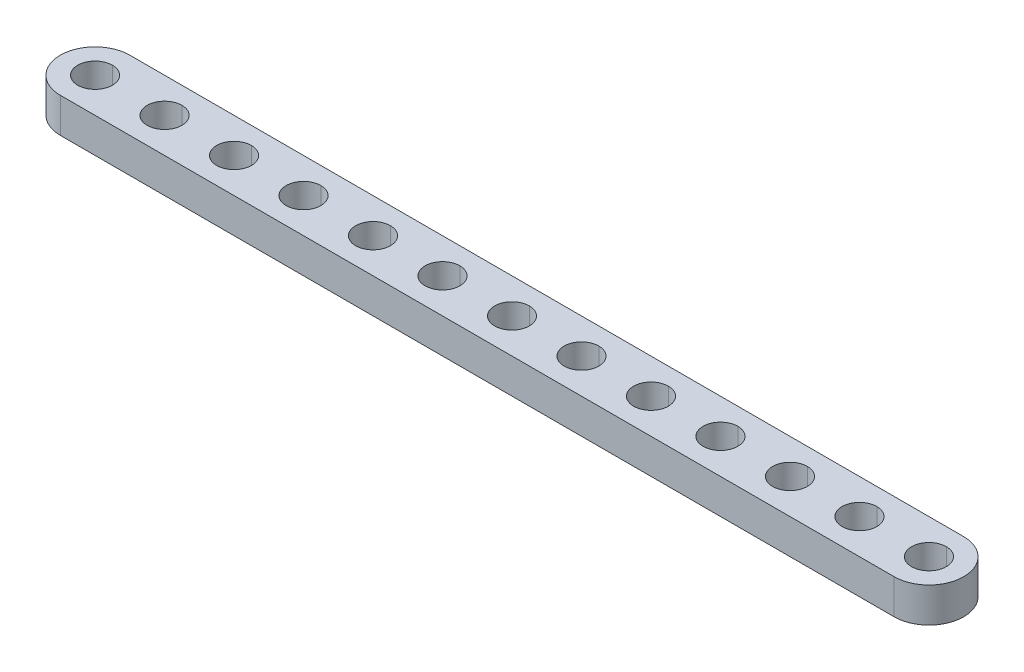
ISO-10303-21;
HEADER;
FILE_DESCRIPTION(('STEP AP214'),'2;1');
FILE_NAME('part.step','',(''),(''),'','','');
FILE_SCHEMA(('AUTOMOTIVE_DESIGN { 1 0 10303 214 1 1 1 1 }'));
ENDSEC;
DATA;
#1=APPLICATION_CONTEXT('core data for automotive mechanical design processes');
#2=APPLICATION_PROTOCOL_DEFINITION('international standard','automotive_design',2000,#1);
#3=PRODUCT_CONTEXT('',#1,'mechanical');
#4=PRODUCT('Part','Part','',(#3));
#5=PRODUCT_RELATED_PRODUCT_CATEGORY('part','',(#4));
#6=PRODUCT_DEFINITION_FORMATION('','',#4);
#7=PRODUCT_DEFINITION_CONTEXT('part definition',#1,'design');
#8=PRODUCT_DEFINITION('design','',#6,#7);
#9=PRODUCT_DEFINITION_SHAPE('','',#8);
#10=(LENGTH_UNIT() NAMED_UNIT(*) SI_UNIT(.MILLI.,.METRE.));
#11=(NAMED_UNIT(*) PLANE_ANGLE_UNIT() SI_UNIT($,.RADIAN.));
#12=(NAMED_UNIT(*) SI_UNIT($,.STERADIAN.) SOLID_ANGLE_UNIT());
#13=UNCERTAINTY_MEASURE_WITH_UNIT(LENGTH_MEASURE(1.E-05),#10,'distance_accuracy_value','');
#14=(GEOMETRIC_REPRESENTATION_CONTEXT(3) GLOBAL_UNCERTAINTY_ASSIGNED_CONTEXT((#13)) GLOBAL_UNIT_ASSIGNED_CONTEXT((#10,
#11,#12)) REPRESENTATION_CONTEXT('',''));
#15=CARTESIAN_POINT('',(0.,0.,0.));
#16=DIRECTION('',(0.,0.,1.));
#17=DIRECTION('',(1.,0.,0.));
#18=AXIS2_PLACEMENT_3D('',#15,#16,#17);
#19=CARTESIAN_POINT('',(48.,4.,0.));
#20=DIRECTION('',(0.,1.,0.));
#21=DIRECTION('',(0.,0.,1.));
#22=AXIS2_PLACEMENT_3D('',#19,#20,#21);
#23=CYLINDRICAL_SURFACE('',#22,2.);
#24=DIRECTION('',(0.,1.,0.));
#25=VECTOR('',#24,1.);
#26=CARTESIAN_POINT('',(48.,4.,-2.));
#27=LINE('',#26,#25);
#28=CARTESIAN_POINT('',(48.,0.,-2.));
#29=VERTEX_POINT('',#28);
#30=CARTESIAN_POINT('',(48.,4.,-2.));
#31=VERTEX_POINT('',#30);
#32=EDGE_CURVE('E298',#29,#31,#27,.T.);
#33=ORIENTED_EDGE('',*,*,#32,.F.);
#34=CARTESIAN_POINT('',(48.,0.,0.));
#35=DIRECTION('',(0.,1.,0.));
#36=DIRECTION('',(0.,0.,1.));
#37=AXIS2_PLACEMENT_3D('',#34,#35,#36);
#38=CIRCLE('',#37,2.);
#39=CARTESIAN_POINT('',(48.,0.,2.));
#40=VERTEX_POINT('',#39);
#41=EDGE_CURVE('E283',#40,#29,#38,.T.);
#42=ORIENTED_EDGE('',*,*,#41,.F.);
#43=DIRECTION('',(0.,1.,0.));
#44=VECTOR('',#43,1.);
#45=CARTESIAN_POINT('',(48.,4.,2.));
#46=LINE('',#45,#44);
#47=CARTESIAN_POINT('',(48.,4.,2.));
#48=VERTEX_POINT('',#47);
#49=EDGE_CURVE('E331',#40,#48,#46,.T.);
#50=ORIENTED_EDGE('',*,*,#49,.T.);
#51=CARTESIAN_POINT('',(48.,4.,0.));
#52=DIRECTION('',(0.,1.,0.));
#53=DIRECTION('',(0.,0.,1.));
#54=AXIS2_PLACEMENT_3D('',#51,#52,#53);
#55=CIRCLE('',#54,2.);
#56=EDGE_CURVE('E362',#48,#31,#55,.T.);
#57=ORIENTED_EDGE('',*,*,#56,.T.);
#58=EDGE_LOOP('',(#33,#42,#50,#57));
#59=FACE_BOUND('',#58,.T.);
#60=ADVANCED_FACE('F14',(#59),#23,.F.);
#61=CARTESIAN_POINT('',(40.,4.,0.));
#62=DIRECTION('',(0.,1.,0.));
#63=DIRECTION('',(0.,0.,1.));
#64=AXIS2_PLACEMENT_3D('',#61,#62,#63);
#65=CYLINDRICAL_SURFACE('',#64,2.);
#66=DIRECTION('',(0.,1.,0.));
#67=VECTOR('',#66,1.);
#68=CARTESIAN_POINT('',(40.,4.,-2.));
#69=LINE('',#68,#67);
#70=CARTESIAN_POINT('',(40.,0.,-2.));
#71=VERTEX_POINT('',#70);
#72=CARTESIAN_POINT('',(40.,4.,-2.));
#73=VERTEX_POINT('',#72);
#74=EDGE_CURVE('E348',#71,#73,#69,.T.);
#75=ORIENTED_EDGE('',*,*,#74,.F.);
#76=CARTESIAN_POINT('',(40.,0.,0.));
#77=DIRECTION('',(0.,1.,0.));
#78=DIRECTION('',(0.,0.,1.));
#79=AXIS2_PLACEMENT_3D('',#76,#77,#78);
#80=CIRCLE('',#79,2.);
#81=CARTESIAN_POINT('',(40.,0.,2.));
#82=VERTEX_POINT('',#81);
#83=EDGE_CURVE('E279',#82,#71,#80,.T.);
#84=ORIENTED_EDGE('',*,*,#83,.F.);
#85=DIRECTION('',(0.,1.,0.));
#86=VECTOR('',#85,1.);
#87=CARTESIAN_POINT('',(40.,4.,2.));
#88=LINE('',#87,#86);
#89=CARTESIAN_POINT('',(40.,4.,2.));
#90=VERTEX_POINT('',#89);
#91=EDGE_CURVE('E347',#82,#90,#88,.T.);
#92=ORIENTED_EDGE('',*,*,#91,.T.);
#93=CARTESIAN_POINT('',(40.,4.,0.));
#94=DIRECTION('',(0.,1.,0.));
#95=DIRECTION('',(0.,0.,1.));
#96=AXIS2_PLACEMENT_3D('',#93,#94,#95);
#97=CIRCLE('',#96,2.);
#98=EDGE_CURVE('E358',#90,#73,#97,.T.);
#99=ORIENTED_EDGE('',*,*,#98,.T.);
#100=EDGE_LOOP('',(#75,#84,#92,#99));
#101=FACE_BOUND('',#100,.T.);
#102=ADVANCED_FACE('F818',(#101),#65,.F.);
#103=CARTESIAN_POINT('',(32.,4.,0.));
#104=DIRECTION('',(0.,1.,0.));
#105=DIRECTION('',(0.,0.,1.));
#106=AXIS2_PLACEMENT_3D('',#103,#104,#105);
#107=CYLINDRICAL_SURFACE('',#106,2.);
#108=DIRECTION('',(0.,1.,0.));
#109=VECTOR('',#108,1.);
#110=CARTESIAN_POINT('',(32.,4.,-2.));
#111=LINE('',#110,#109);
#112=CARTESIAN_POINT('',(32.,0.,-2.));
#113=VERTEX_POINT('',#112);
#114=CARTESIAN_POINT('',(32.,4.,-2.));
#115=VERTEX_POINT('',#114);
#116=EDGE_CURVE('E316',#113,#115,#111,.T.);
#117=ORIENTED_EDGE('',*,*,#116,.F.);
#118=CARTESIAN_POINT('',(32.,0.,0.));
#119=DIRECTION('',(0.,1.,0.));
#120=DIRECTION('',(0.,0.,1.));
#121=AXIS2_PLACEMENT_3D('',#118,#119,#120);
#122=CIRCLE('',#121,2.);
#123=CARTESIAN_POINT('',(32.,0.,2.));
#124=VERTEX_POINT('',#123);
#125=EDGE_CURVE('E282',#124,#113,#122,.T.);
#126=ORIENTED_EDGE('',*,*,#125,.F.);
#127=DIRECTION('',(0.,1.,0.));
#128=VECTOR('',#127,1.);
#129=CARTESIAN_POINT('',(32.,4.,2.));
#130=LINE('',#129,#128);
#131=CARTESIAN_POINT('',(32.,4.,2.));
#132=VERTEX_POINT('',#131);
#133=EDGE_CURVE('E370',#124,#132,#130,.T.);
#134=ORIENTED_EDGE('',*,*,#133,.T.);
#135=CARTESIAN_POINT('',(32.,4.,0.));
#136=DIRECTION('',(0.,1.,0.));
#137=DIRECTION('',(0.,0.,1.));
#138=AXIS2_PLACEMENT_3D('',#135,#136,#137);
#139=CIRCLE('',#138,2.);
#140=EDGE_CURVE('E315',#132,#115,#139,.T.);
#141=ORIENTED_EDGE('',*,*,#140,.T.);
#142=EDGE_LOOP('',(#117,#126,#134,#141));
#143=FACE_BOUND('',#142,.T.);
#144=ADVANCED_FACE('F441',(#143),#107,.F.);
#145=CARTESIAN_POINT('',(24.,4.,0.));
#146=DIRECTION('',(0.,1.,0.));
#147=DIRECTION('',(0.,0.,1.));
#148=AXIS2_PLACEMENT_3D('',#145,#146,#147);
#149=CYLINDRICAL_SURFACE('',#148,2.);
#150=DIRECTION('',(0.,1.,0.));
#151=VECTOR('',#150,1.);
#152=CARTESIAN_POINT('',(24.,4.,-2.));
#153=LINE('',#152,#151);
#154=CARTESIAN_POINT('',(24.,0.,-2.));
#155=VERTEX_POINT('',#154);
#156=CARTESIAN_POINT('',(24.,4.,-2.));
#157=VERTEX_POINT('',#156);
#158=EDGE_CURVE('E476',#155,#157,#153,.T.);
#159=ORIENTED_EDGE('',*,*,#158,.F.);
#160=CARTESIAN_POINT('',(24.,0.,0.));
#161=DIRECTION('',(0.,1.,0.));
#162=DIRECTION('',(0.,0.,1.));
#163=AXIS2_PLACEMENT_3D('',#160,#161,#162);
#164=CIRCLE('',#163,2.);
#165=CARTESIAN_POINT('',(24.,0.,2.));
#166=VERTEX_POINT('',#165);
#167=EDGE_CURVE('E306',#166,#155,#164,.T.);
#168=ORIENTED_EDGE('',*,*,#167,.F.);
#169=DIRECTION('',(0.,1.,0.));
#170=VECTOR('',#169,1.);
#171=CARTESIAN_POINT('',(24.,4.,2.));
#172=LINE('',#171,#170);
#173=CARTESIAN_POINT('',(24.,4.,2.));
#174=VERTEX_POINT('',#173);
#175=EDGE_CURVE('E239',#166,#174,#172,.T.);
#176=ORIENTED_EDGE('',*,*,#175,.T.);
#177=CARTESIAN_POINT('',(24.,4.,0.));
#178=DIRECTION('',(0.,1.,0.));
#179=DIRECTION('',(0.,0.,1.));
#180=AXIS2_PLACEMENT_3D('',#177,#178,#179);
#181=CIRCLE('',#180,2.);
#182=EDGE_CURVE('E310',#174,#157,#181,.T.);
#183=ORIENTED_EDGE('',*,*,#182,.T.);
#184=EDGE_LOOP('',(#159,#168,#176,#183));
#185=FACE_BOUND('',#184,.T.);
#186=ADVANCED_FACE('F817',(#185),#149,.F.);
#187=CARTESIAN_POINT('',(16.,4.,0.));
#188=DIRECTION('',(0.,1.,0.));
#189=DIRECTION('',(0.,0.,1.));
#190=AXIS2_PLACEMENT_3D('',#187,#188,#189);
#191=CYLINDRICAL_SURFACE('',#190,2.);
#192=DIRECTION('',(0.,1.,0.));
#193=VECTOR('',#192,1.);
#194=CARTESIAN_POINT('',(16.,4.,-2.));
#195=LINE('',#194,#193);
#196=CARTESIAN_POINT('',(16.,0.,-2.));
#197=VERTEX_POINT('',#196);
#198=CARTESIAN_POINT('',(16.,4.,-2.));
#199=VERTEX_POINT('',#198);
#200=EDGE_CURVE('E238',#197,#199,#195,.T.);
#201=ORIENTED_EDGE('',*,*,#200,.F.);
#202=CARTESIAN_POINT('',(16.,0.,0.));
#203=DIRECTION('',(0.,1.,0.));
#204=DIRECTION('',(0.,0.,1.));
#205=AXIS2_PLACEMENT_3D('',#202,#203,#204);
#206=CIRCLE('',#205,2.);
#207=CARTESIAN_POINT('',(16.,0.,2.));
#208=VERTEX_POINT('',#207);
#209=EDGE_CURVE('E330',#208,#197,#206,.T.);
#210=ORIENTED_EDGE('',*,*,#209,.F.);
#211=DIRECTION('',(0.,1.,0.));
#212=VECTOR('',#211,1.);
#213=CARTESIAN_POINT('',(16.,4.,2.));
#214=LINE('',#213,#212);
#215=CARTESIAN_POINT('',(16.,4.,2.));
#216=VERTEX_POINT('',#215);
#217=EDGE_CURVE('E352',#208,#216,#214,.T.);
#218=ORIENTED_EDGE('',*,*,#217,.T.);
#219=CARTESIAN_POINT('',(16.,4.,0.));
#220=DIRECTION('',(0.,1.,0.));
#221=DIRECTION('',(0.,0.,1.));
#222=AXIS2_PLACEMENT_3D('',#219,#220,#221);
#223=CIRCLE('',#222,2.);
#224=EDGE_CURVE('E314',#216,#199,#223,.T.);
#225=ORIENTED_EDGE('',*,*,#224,.T.);
#226=EDGE_LOOP('',(#201,#210,#218,#225));
#227=FACE_BOUND('',#226,.T.);
#228=ADVANCED_FACE('F809',(#227),#191,.F.);
#229=CARTESIAN_POINT('',(8.,4.,0.));
#230=DIRECTION('',(0.,1.,0.));
#231=DIRECTION('',(0.,0.,1.));
#232=AXIS2_PLACEMENT_3D('',#229,#230,#231);
#233=CYLINDRICAL_SURFACE('',#232,2.);
#234=DIRECTION('',(0.,1.,0.));
#235=VECTOR('',#234,1.);
#236=CARTESIAN_POINT('',(8.,4.,-2.));
#237=LINE('',#236,#235);
#238=CARTESIAN_POINT('',(8.,0.,-2.));
#239=VERTEX_POINT('',#238);
#240=CARTESIAN_POINT('',(8.,4.,-2.));
#241=VERTEX_POINT('',#240);
#242=EDGE_CURVE('E297',#239,#241,#237,.T.);
#243=ORIENTED_EDGE('',*,*,#242,.F.);
#244=CARTESIAN_POINT('',(8.,0.,0.));
#245=DIRECTION('',(0.,1.,0.));
#246=DIRECTION('',(0.,0.,1.));
#247=AXIS2_PLACEMENT_3D('',#244,#245,#246);
#248=CIRCLE('',#247,2.);
#249=CARTESIAN_POINT('',(8.,0.,2.));
#250=VERTEX_POINT('',#249);
#251=EDGE_CURVE('E18',#250,#239,#248,.T.);
#252=ORIENTED_EDGE('',*,*,#251,.F.);
#253=DIRECTION('',(0.,1.,0.));
#254=VECTOR('',#253,1.);
#255=CARTESIAN_POINT('',(8.,4.,2.));
#256=LINE('',#255,#254);
#257=CARTESIAN_POINT('',(8.,4.,2.));
#258=VERTEX_POINT('',#257);
#259=EDGE_CURVE('E233',#250,#258,#256,.T.);
#260=ORIENTED_EDGE('',*,*,#259,.T.);
#261=CARTESIAN_POINT('',(8.,4.,0.));
#262=DIRECTION('',(0.,1.,0.));
#263=DIRECTION('',(0.,0.,1.));
#264=AXIS2_PLACEMENT_3D('',#261,#262,#263);
#265=CIRCLE('',#264,2.);
#266=EDGE_CURVE('E392',#258,#241,#265,.T.);
#267=ORIENTED_EDGE('',*,*,#266,.T.);
#268=EDGE_LOOP('',(#243,#252,#260,#267));
#269=FACE_BOUND('',#268,.T.);
#270=ADVANCED_FACE('F576',(#269),#233,.F.);
#271=CARTESIAN_POINT('',(0.,4.,0.));
#272=DIRECTION('',(0.,1.,0.));
#273=DIRECTION('',(0.,0.,1.));
#274=AXIS2_PLACEMENT_3D('',#271,#272,#273);
#275=CYLINDRICAL_SURFACE('',#274,2.);
#276=DIRECTION('',(0.,1.,0.));
#277=VECTOR('',#276,1.);
#278=CARTESIAN_POINT('',(0.,4.,-2.));
#279=LINE('',#278,#277);
#280=CARTESIAN_POINT('',(0.,0.,-2.));
#281=VERTEX_POINT('',#280);
#282=CARTESIAN_POINT('',(0.,4.,-2.));
#283=VERTEX_POINT('',#282);
#284=EDGE_CURVE('E287',#281,#283,#279,.T.);
#285=ORIENTED_EDGE('',*,*,#284,.F.);
#286=CARTESIAN_POINT('',(0.,0.,0.));
#287=DIRECTION('',(0.,1.,0.));
#288=DIRECTION('',(0.,0.,1.));
#289=AXIS2_PLACEMENT_3D('',#286,#287,#288);
#290=CIRCLE('',#289,2.);
#291=CARTESIAN_POINT('',(0.,0.,2.));
#292=VERTEX_POINT('',#291);
#293=EDGE_CURVE('E432',#292,#281,#290,.T.);
#294=ORIENTED_EDGE('',*,*,#293,.F.);
#295=DIRECTION('',(0.,1.,0.));
#296=VECTOR('',#295,1.);
#297=CARTESIAN_POINT('',(0.,4.,2.));
#298=LINE('',#297,#296);
#299=CARTESIAN_POINT('',(0.,4.,2.));
#300=VERTEX_POINT('',#299);
#301=EDGE_CURVE('E268',#292,#300,#298,.T.);
#302=ORIENTED_EDGE('',*,*,#301,.T.);
#303=CARTESIAN_POINT('',(0.,4.,0.));
#304=DIRECTION('',(0.,1.,0.));
#305=DIRECTION('',(0.,0.,1.));
#306=AXIS2_PLACEMENT_3D('',#303,#304,#305);
#307=CIRCLE('',#306,2.);
#308=EDGE_CURVE('E518',#300,#283,#307,.T.);
#309=ORIENTED_EDGE('',*,*,#308,.T.);
#310=EDGE_LOOP('',(#285,#294,#302,#309));
#311=FACE_BOUND('',#310,.T.);
#312=ADVANCED_FACE('F808',(#311),#275,.F.);
#313=CARTESIAN_POINT('',(-8.,4.,0.));
#314=DIRECTION('',(0.,1.,0.));
#315=DIRECTION('',(0.,0.,1.));
#316=AXIS2_PLACEMENT_3D('',#313,#314,#315);
#317=CYLINDRICAL_SURFACE('',#316,2.);
#318=DIRECTION('',(0.,1.,0.));
#319=VECTOR('',#318,1.);
#320=CARTESIAN_POINT('',(-8.,4.,-2.));
#321=LINE('',#320,#319);
#322=CARTESIAN_POINT('',(-8.,0.,-2.));
#323=VERTEX_POINT('',#322);
#324=CARTESIAN_POINT('',(-8.,4.,-2.));
#325=VERTEX_POINT('',#324);
#326=EDGE_CURVE('E486',#323,#325,#321,.T.);
#327=ORIENTED_EDGE('',*,*,#326,.F.);
#328=CARTESIAN_POINT('',(-8.,0.,0.));
#329=DIRECTION('',(0.,1.,0.));
#330=DIRECTION('',(0.,0.,1.));
#331=AXIS2_PLACEMENT_3D('',#328,#329,#330);
#332=CIRCLE('',#331,2.);
#333=CARTESIAN_POINT('',(-8.,0.,2.));
#334=VERTEX_POINT('',#333);
#335=EDGE_CURVE('E402',#334,#323,#332,.T.);
#336=ORIENTED_EDGE('',*,*,#335,.F.);
#337=DIRECTION('',(0.,1.,0.));
#338=VECTOR('',#337,1.);
#339=CARTESIAN_POINT('',(-8.,4.,2.));
#340=LINE('',#339,#338);
#341=CARTESIAN_POINT('',(-8.,4.,2.));
#342=VERTEX_POINT('',#341);
#343=EDGE_CURVE('E388',#334,#342,#340,.T.);
#344=ORIENTED_EDGE('',*,*,#343,.T.);
#345=CARTESIAN_POINT('',(-8.,4.,0.));
#346=DIRECTION('',(0.,1.,0.));
#347=DIRECTION('',(0.,0.,1.));
#348=AXIS2_PLACEMENT_3D('',#345,#346,#347);
#349=CIRCLE('',#348,2.);
#350=EDGE_CURVE('E292',#342,#325,#349,.T.);
#351=ORIENTED_EDGE('',*,*,#350,.T.);
#352=EDGE_LOOP('',(#327,#336,#344,#351));
#353=FACE_BOUND('',#352,.T.);
#354=ADVANCED_FACE('F859',(#353),#317,.F.);
#355=CARTESIAN_POINT('',(-16.,4.,0.));
#356=DIRECTION('',(0.,1.,0.));
#357=DIRECTION('',(0.,0.,1.));
#358=AXIS2_PLACEMENT_3D('',#355,#356,#357);
#359=CYLINDRICAL_SURFACE('',#358,2.);
#360=DIRECTION('',(0.,1.,0.));
#361=VECTOR('',#360,1.);
#362=CARTESIAN_POINT('',(-16.,4.,-2.));
#363=LINE('',#362,#361);
#364=CARTESIAN_POINT('',(-16.,0.,-2.));
#365=VERTEX_POINT('',#364);
#366=CARTESIAN_POINT('',(-16.,4.,-2.));
#367=VERTEX_POINT('',#366);
#368=EDGE_CURVE('E357',#365,#367,#363,.T.);
#369=ORIENTED_EDGE('',*,*,#368,.F.);
#370=CARTESIAN_POINT('',(-16.,0.,0.));
#371=DIRECTION('',(0.,1.,0.));
#372=DIRECTION('',(0.,0.,1.));
#373=AXIS2_PLACEMENT_3D('',#370,#371,#372);
#374=CIRCLE('',#373,2.);
#375=CARTESIAN_POINT('',(-16.,0.,2.));
#376=VERTEX_POINT('',#375);
#377=EDGE_CURVE('E398',#376,#365,#374,.T.);
#378=ORIENTED_EDGE('',*,*,#377,.F.);
#379=DIRECTION('',(0.,1.,0.));
#380=VECTOR('',#379,1.);
#381=CARTESIAN_POINT('',(-16.,4.,2.));
#382=LINE('',#381,#380);
#383=CARTESIAN_POINT('',(-16.,4.,2.));
#384=VERTEX_POINT('',#383);
#385=EDGE_CURVE('E326',#376,#384,#382,.T.);
#386=ORIENTED_EDGE('',*,*,#385,.T.);
#387=CARTESIAN_POINT('',(-16.,4.,0.));
#388=DIRECTION('',(0.,1.,0.));
#389=DIRECTION('',(0.,0.,1.));
#390=AXIS2_PLACEMENT_3D('',#387,#388,#389);
#391=CIRCLE('',#390,2.);
#392=EDGE_CURVE('E288',#384,#367,#391,.T.);
#393=ORIENTED_EDGE('',*,*,#392,.T.);
#394=EDGE_LOOP('',(#369,#378,#386,#393));
#395=FACE_BOUND('',#394,.T.);
#396=ADVANCED_FACE('F901',(#395),#359,.F.);
#397=CARTESIAN_POINT('',(-24.,4.,0.));
#398=DIRECTION('',(0.,1.,0.));
#399=DIRECTION('',(0.,0.,1.));
#400=AXIS2_PLACEMENT_3D('',#397,#398,#399);
#401=CYLINDRICAL_SURFACE('',#400,2.);
#402=DIRECTION('',(0.,1.,0.));
#403=VECTOR('',#402,1.);
#404=CARTESIAN_POINT('',(-24.,4.,-2.));
#405=LINE('',#404,#403);
#406=CARTESIAN_POINT('',(-24.,0.,-2.));
#407=VERTEX_POINT('',#406);
#408=CARTESIAN_POINT('',(-24.,4.,-2.));
#409=VERTEX_POINT('',#408);
#410=EDGE_CURVE('E325',#407,#409,#405,.T.);
#411=ORIENTED_EDGE('',*,*,#410,.F.);
#412=CARTESIAN_POINT('',(-24.,0.,0.));
#413=DIRECTION('',(0.,1.,0.));
#414=DIRECTION('',(0.,0.,1.));
#415=AXIS2_PLACEMENT_3D('',#412,#413,#414);
#416=CIRCLE('',#415,2.);
#417=CARTESIAN_POINT('',(-24.,0.,2.));
#418=VERTEX_POINT('',#417);
#419=EDGE_CURVE('E401',#418,#407,#416,.T.);
#420=ORIENTED_EDGE('',*,*,#419,.F.);
#421=DIRECTION('',(0.,1.,0.));
#422=VECTOR('',#421,1.);
#423=CARTESIAN_POINT('',(-24.,4.,2.));
#424=LINE('',#423,#422);
#425=CARTESIAN_POINT('',(-24.,4.,2.));
#426=VERTEX_POINT('',#425);
#427=EDGE_CURVE('E229',#418,#426,#424,.T.);
#428=ORIENTED_EDGE('',*,*,#427,.T.);
#429=CARTESIAN_POINT('',(-24.,4.,0.));
#430=DIRECTION('',(0.,1.,0.));
#431=DIRECTION('',(0.,0.,1.));
#432=AXIS2_PLACEMENT_3D('',#429,#430,#431);
#433=CIRCLE('',#432,2.);
#434=EDGE_CURVE('E211',#426,#409,#433,.T.);
#435=ORIENTED_EDGE('',*,*,#434,.T.);
#436=EDGE_LOOP('',(#411,#420,#428,#435));
#437=FACE_BOUND('',#436,.T.);
#438=ADVANCED_FACE('F947',(#437),#401,.F.);
#439=CARTESIAN_POINT('',(-32.,4.,0.));
#440=DIRECTION('',(0.,1.,0.));
#441=DIRECTION('',(0.,0.,1.));
#442=AXIS2_PLACEMENT_3D('',#439,#440,#441);
#443=CYLINDRICAL_SURFACE('',#442,2.);
#444=DIRECTION('',(0.,1.,0.));
#445=VECTOR('',#444,1.);
#446=CARTESIAN_POINT('',(-32.,4.,-2.));
#447=LINE('',#446,#445);
#448=CARTESIAN_POINT('',(-32.,0.,-2.));
#449=VERTEX_POINT('',#448);
#450=CARTESIAN_POINT('',(-32.,4.,-2.));
#451=VERTEX_POINT('',#450);
#452=EDGE_CURVE('E203',#449,#451,#447,.T.);
#453=ORIENTED_EDGE('',*,*,#452,.F.);
#454=CARTESIAN_POINT('',(-32.,0.,0.));
#455=DIRECTION('',(0.,1.,0.));
#456=DIRECTION('',(0.,0.,1.));
#457=AXIS2_PLACEMENT_3D('',#454,#455,#456);
#458=CIRCLE('',#457,2.);
#459=CARTESIAN_POINT('',(-32.,0.,2.));
#460=VERTEX_POINT('',#459);
#461=EDGE_CURVE('E421',#460,#449,#458,.T.);
#462=ORIENTED_EDGE('',*,*,#461,.F.);
#463=DIRECTION('',(0.,1.,0.));
#464=VECTOR('',#463,1.);
#465=CARTESIAN_POINT('',(-32.,4.,2.));
#466=LINE('',#465,#464);
#467=CARTESIAN_POINT('',(-32.,4.,2.));
#468=VERTEX_POINT('',#467);
#469=EDGE_CURVE('E206',#460,#468,#466,.T.);
#470=ORIENTED_EDGE('',*,*,#469,.T.);
#471=CARTESIAN_POINT('',(-32.,4.,0.));
#472=DIRECTION('',(0.,1.,0.));
#473=DIRECTION('',(0.,0.,1.));
#474=AXIS2_PLACEMENT_3D('',#471,#472,#473);
#475=CIRCLE('',#474,2.);
#476=EDGE_CURVE('E199',#468,#451,#475,.T.);
#477=ORIENTED_EDGE('',*,*,#476,.T.);
#478=EDGE_LOOP('',(#453,#462,#470,#477));
#479=FACE_BOUND('',#478,.T.);
#480=ADVANCED_FACE('F201',(#479),#443,.F.);
#481=CARTESIAN_POINT('',(-40.,4.,0.));
#482=DIRECTION('',(0.,1.,0.));
#483=DIRECTION('',(0.,0.,1.));
#484=AXIS2_PLACEMENT_3D('',#481,#482,#483);
#485=CYLINDRICAL_SURFACE('',#484,2.);
#486=DIRECTION('',(0.,1.,0.));
#487=VECTOR('',#486,1.);
#488=CARTESIAN_POINT('',(-40.,4.,-2.));
#489=LINE('',#488,#487);
#490=CARTESIAN_POINT('',(-40.,0.,-2.));
#491=VERTEX_POINT('',#490);
#492=CARTESIAN_POINT('',(-40.,4.,-2.));
#493=VERTEX_POINT('',#492);
#494=EDGE_CURVE('E262',#491,#493,#489,.T.);
#495=ORIENTED_EDGE('',*,*,#494,.F.);
#496=CARTESIAN_POINT('',(-40.,0.,0.));
#497=DIRECTION('',(0.,1.,0.));
#498=DIRECTION('',(0.,0.,1.));
#499=AXIS2_PLACEMENT_3D('',#496,#497,#498);
#500=CIRCLE('',#499,2.);
#501=CARTESIAN_POINT('',(-40.,0.,2.));
#502=VERTEX_POINT('',#501);
#503=EDGE_CURVE('E25',#502,#491,#500,.T.);
#504=ORIENTED_EDGE('',*,*,#503,.F.);
#505=DIRECTION('',(0.,1.,0.));
#506=VECTOR('',#505,1.);
#507=CARTESIAN_POINT('',(-40.,4.,2.));
#508=LINE('',#507,#506);
#509=CARTESIAN_POINT('',(-40.,4.,2.));
#510=VERTEX_POINT('',#509);
#511=EDGE_CURVE('E267',#502,#510,#508,.T.);
#512=ORIENTED_EDGE('',*,*,#511,.T.);
#513=CARTESIAN_POINT('',(-40.,4.,0.));
#514=DIRECTION('',(0.,1.,0.));
#515=DIRECTION('',(0.,0.,1.));
#516=AXIS2_PLACEMENT_3D('',#513,#514,#515);
#517=CIRCLE('',#516,2.);
#518=EDGE_CURVE('E210',#510,#493,#517,.T.);
#519=ORIENTED_EDGE('',*,*,#518,.T.);
#520=EDGE_LOOP('',(#495,#504,#512,#519));
#521=FACE_BOUND('',#520,.T.);
#522=ADVANCED_FACE('F749',(#521),#485,.F.);
#523=CARTESIAN_POINT('',(-48.,4.,0.));
#524=DIRECTION('',(0.,1.,0.));
#525=DIRECTION('',(0.,0.,1.));
#526=AXIS2_PLACEMENT_3D('',#523,#524,#525);
#527=CYLINDRICAL_SURFACE('',#526,2.);
#528=DIRECTION('',(0.,1.,0.));
#529=VECTOR('',#528,1.);
#530=CARTESIAN_POINT('',(-48.,4.,-2.));
#531=LINE('',#530,#529);
#532=CARTESIAN_POINT('',(-48.,0.,-2.));
#533=VERTEX_POINT('',#532);
#534=CARTESIAN_POINT('',(-48.,4.,-2.));
#535=VERTEX_POINT('',#534);
#536=EDGE_CURVE('E416',#533,#535,#531,.T.);
#537=ORIENTED_EDGE('',*,*,#536,.F.);
#538=CARTESIAN_POINT('',(-48.,0.,0.));
#539=DIRECTION('',(0.,1.,0.));
#540=DIRECTION('',(0.,0.,1.));
#541=AXIS2_PLACEMENT_3D('',#538,#539,#540);
#542=CIRCLE('',#541,2.);
#543=CARTESIAN_POINT('',(-48.,0.,2.));
#544=VERTEX_POINT('',#543);
#545=EDGE_CURVE('E9',#544,#533,#542,.T.);
#546=ORIENTED_EDGE('',*,*,#545,.F.);
#547=DIRECTION('',(0.,1.,0.));
#548=VECTOR('',#547,1.);
#549=CARTESIAN_POINT('',(-48.,4.,2.));
#550=LINE('',#549,#548);
#551=CARTESIAN_POINT('',(-48.,4.,2.));
#552=VERTEX_POINT('',#551);
#553=EDGE_CURVE('E274',#544,#552,#550,.T.);
#554=ORIENTED_EDGE('',*,*,#553,.T.);
#555=CARTESIAN_POINT('',(-48.,4.,0.));
#556=DIRECTION('',(0.,1.,0.));
#557=DIRECTION('',(0.,0.,1.));
#558=AXIS2_PLACEMENT_3D('',#555,#556,#557);
#559=CIRCLE('',#558,2.);
#560=EDGE_CURVE('E363',#552,#535,#559,.T.);
#561=ORIENTED_EDGE('',*,*,#560,.T.);
#562=EDGE_LOOP('',(#537,#546,#554,#561));
#563=FACE_BOUND('',#562,.T.);
#564=ADVANCED_FACE('F753',(#563),#527,.F.);
#565=CARTESIAN_POINT('',(-48.,0.,0.));
#566=DIRECTION('',(0.,1.,0.));
#567=DIRECTION('',(1.,0.,0.));
#568=AXIS2_PLACEMENT_3D('',#565,#566,#567);
#569=PLANE('',#568);
#570=ORIENTED_EDGE('',*,*,#545,.T.);
#571=CARTESIAN_POINT('',(-48.,0.,0.));
#572=DIRECTION('',(0.,1.,0.));
#573=DIRECTION('',(0.,0.,1.));
#574=AXIS2_PLACEMENT_3D('',#571,#572,#573);
#575=CIRCLE('',#574,2.);
#576=EDGE_CURVE('E420',#533,#544,#575,.T.);
#577=ORIENTED_EDGE('',*,*,#576,.T.);
#578=EDGE_LOOP('',(#570,#577));
#579=FACE_BOUND('',#578,.T.);
#580=ORIENTED_EDGE('',*,*,#503,.T.);
#581=CARTESIAN_POINT('',(-40.,0.,0.));
#582=DIRECTION('',(0.,1.,0.));
#583=DIRECTION('',(0.,0.,1.));
#584=AXIS2_PLACEMENT_3D('',#581,#582,#583);
#585=CIRCLE('',#584,2.);
#586=EDGE_CURVE('E258',#491,#502,#585,.T.);
#587=ORIENTED_EDGE('',*,*,#586,.T.);
#588=EDGE_LOOP('',(#580,#587));
#589=FACE_BOUND('',#588,.T.);
#590=ORIENTED_EDGE('',*,*,#461,.T.);
#591=CARTESIAN_POINT('',(-32.,0.,0.));
#592=DIRECTION('',(0.,1.,0.));
#593=DIRECTION('',(0.,0.,1.));
#594=AXIS2_PLACEMENT_3D('',#591,#592,#593);
#595=CIRCLE('',#594,2.);
#596=EDGE_CURVE('E221',#449,#460,#595,.T.);
#597=ORIENTED_EDGE('',*,*,#596,.T.);
#598=EDGE_LOOP('',(#590,#597));
#599=FACE_BOUND('',#598,.T.);
#600=ORIENTED_EDGE('',*,*,#419,.T.);
#601=CARTESIAN_POINT('',(-24.,0.,0.));
#602=DIRECTION('',(0.,1.,0.));
#603=DIRECTION('',(0.,0.,1.));
#604=AXIS2_PLACEMENT_3D('',#601,#602,#603);
#605=CIRCLE('',#604,2.);
#606=EDGE_CURVE('E322',#407,#418,#605,.T.);
#607=ORIENTED_EDGE('',*,*,#606,.T.);
#608=EDGE_LOOP('',(#600,#607));
#609=FACE_BOUND('',#608,.T.);
#610=ORIENTED_EDGE('',*,*,#377,.T.);
#611=CARTESIAN_POINT('',(-16.,0.,0.));
#612=DIRECTION('',(0.,1.,0.));
#613=DIRECTION('',(0.,0.,1.));
#614=AXIS2_PLACEMENT_3D('',#611,#612,#613);
#615=CIRCLE('',#614,2.);
#616=EDGE_CURVE('E384',#365,#376,#615,.T.);
#617=ORIENTED_EDGE('',*,*,#616,.T.);
#618=EDGE_LOOP('',(#610,#617));
#619=FACE_BOUND('',#618,.T.);
#620=ORIENTED_EDGE('',*,*,#335,.T.);
#621=CARTESIAN_POINT('',(-8.,0.,0.));
#622=DIRECTION('',(0.,1.,0.));
#623=DIRECTION('',(0.,0.,1.));
#624=AXIS2_PLACEMENT_3D('',#621,#622,#623);
#625=CIRCLE('',#624,2.);
#626=EDGE_CURVE('E272',#323,#334,#625,.T.);
#627=ORIENTED_EDGE('',*,*,#626,.T.);
#628=EDGE_LOOP('',(#620,#627));
#629=FACE_BOUND('',#628,.T.);
#630=ORIENTED_EDGE('',*,*,#293,.T.);
#631=CARTESIAN_POINT('',(0.,0.,0.));
#632=DIRECTION('',(0.,1.,0.));
#633=DIRECTION('',(0.,0.,1.));
#634=AXIS2_PLACEMENT_3D('',#631,#632,#633);
#635=CIRCLE('',#634,2.);
#636=EDGE_CURVE('E415',#281,#292,#635,.T.);
#637=ORIENTED_EDGE('',*,*,#636,.T.);
#638=EDGE_LOOP('',(#630,#637));
#639=FACE_BOUND('',#638,.T.);
#640=ORIENTED_EDGE('',*,*,#251,.T.);
#641=CARTESIAN_POINT('',(8.,0.,0.));
#642=DIRECTION('',(0.,1.,0.));
#643=DIRECTION('',(0.,0.,1.));
#644=AXIS2_PLACEMENT_3D('',#641,#642,#643);
#645=CIRCLE('',#644,2.);
#646=EDGE_CURVE('E342',#239,#250,#645,.T.);
#647=ORIENTED_EDGE('',*,*,#646,.T.);
#648=EDGE_LOOP('',(#640,#647));
#649=FACE_BOUND('',#648,.T.);
#650=ORIENTED_EDGE('',*,*,#209,.T.);
#651=CARTESIAN_POINT('',(16.,0.,0.));
#652=DIRECTION('',(0.,1.,0.));
#653=DIRECTION('',(0.,0.,1.));
#654=AXIS2_PLACEMENT_3D('',#651,#652,#653);
#655=CIRCLE('',#654,2.);
#656=EDGE_CURVE('E235',#197,#208,#655,.T.);
#657=ORIENTED_EDGE('',*,*,#656,.T.);
#658=EDGE_LOOP('',(#650,#657));
#659=FACE_BOUND('',#658,.T.);
#660=ORIENTED_EDGE('',*,*,#167,.T.);
#661=CARTESIAN_POINT('',(24.,0.,0.));
#662=DIRECTION('',(0.,1.,0.));
#663=DIRECTION('',(0.,0.,1.));
#664=AXIS2_PLACEMENT_3D('',#661,#662,#663);
#665=CIRCLE('',#664,2.);
#666=EDGE_CURVE('E374',#155,#166,#665,.T.);
#667=ORIENTED_EDGE('',*,*,#666,.T.);
#668=EDGE_LOOP('',(#660,#667));
#669=FACE_BOUND('',#668,.T.);
#670=ORIENTED_EDGE('',*,*,#125,.T.);
#671=CARTESIAN_POINT('',(32.,0.,0.));
#672=DIRECTION('',(0.,1.,0.));
#673=DIRECTION('',(0.,0.,1.));
#674=AXIS2_PLACEMENT_3D('',#671,#672,#673);
#675=CIRCLE('',#674,2.);
#676=EDGE_CURVE('E321',#113,#124,#675,.T.);
#677=ORIENTED_EDGE('',*,*,#676,.T.);
#678=EDGE_LOOP('',(#670,#677));
#679=FACE_BOUND('',#678,.T.);
#680=ORIENTED_EDGE('',*,*,#83,.T.);
#681=CARTESIAN_POINT('',(40.,0.,0.));
#682=DIRECTION('',(0.,1.,0.));
#683=DIRECTION('',(0.,0.,1.));
#684=AXIS2_PLACEMENT_3D('',#681,#682,#683);
#685=CIRCLE('',#684,2.);
#686=EDGE_CURVE('E335',#71,#82,#685,.T.);
#687=ORIENTED_EDGE('',*,*,#686,.T.);
#688=EDGE_LOOP('',(#680,#687));
#689=FACE_BOUND('',#688,.T.);
#690=ORIENTED_EDGE('',*,*,#41,.T.);
#691=CARTESIAN_POINT('',(48.,0.,0.));
#692=DIRECTION('',(0.,1.,0.));
#693=DIRECTION('',(0.,0.,1.));
#694=AXIS2_PLACEMENT_3D('',#691,#692,#693);
#695=CIRCLE('',#694,2.);
#696=EDGE_CURVE('E303',#29,#40,#695,.T.);
#697=ORIENTED_EDGE('',*,*,#696,.T.);
#698=EDGE_LOOP('',(#690,#697));
#699=FACE_BOUND('',#698,.T.);
#700=CARTESIAN_POINT('',(-48.,0.,0.));
#701=DIRECTION('',(0.,1.,0.));
#702=DIRECTION('',(0.,0.,1.));
#703=AXIS2_PLACEMENT_3D('',#700,#701,#702);
#704=CIRCLE('',#703,4.);
#705=CARTESIAN_POINT('',(-48.,0.,-4.));
#706=VERTEX_POINT('',#705);
#707=CARTESIAN_POINT('',(-48.,0.,4.));
#708=VERTEX_POINT('',#707);
#709=EDGE_CURVE('E257',#706,#708,#704,.T.);
#710=ORIENTED_EDGE('',*,*,#709,.F.);
#711=DIRECTION('',(-1.,0.,0.));
#712=VECTOR('',#711,1.);
#713=CARTESIAN_POINT('',(-48.,0.,-4.));
#714=LINE('',#713,#712);
#715=CARTESIAN_POINT('',(48.,0.,-4.));
#716=VERTEX_POINT('',#715);
#717=EDGE_CURVE('E403',#716,#706,#714,.T.);
#718=ORIENTED_EDGE('',*,*,#717,.F.);
#719=CARTESIAN_POINT('',(48.,0.,0.));
#720=DIRECTION('',(0.,1.,0.));
#721=DIRECTION('',(0.,0.,1.));
#722=AXIS2_PLACEMENT_3D('',#719,#720,#721);
#723=CIRCLE('',#722,4.);
#724=CARTESIAN_POINT('',(48.,0.,4.));
#725=VERTEX_POINT('',#724);
#726=EDGE_CURVE('E246',#725,#716,#723,.T.);
#727=ORIENTED_EDGE('',*,*,#726,.F.);
#728=DIRECTION('',(1.,0.,0.));
#729=VECTOR('',#728,1.);
#730=CARTESIAN_POINT('',(-48.,0.,4.));
#731=LINE('',#730,#729);
#732=EDGE_CURVE('E240',#708,#725,#731,.T.);
#733=ORIENTED_EDGE('',*,*,#732,.F.);
#734=EDGE_LOOP('',(#710,#718,#727,#733));
#735=FACE_BOUND('',#734,.T.);
#736=ADVANCED_FACE('F569',(#579,#589,#599,#609,#619,#629,#639,#649,#659,#669,#679,#689,#699,
#735),#569,.F.);
#737=CARTESIAN_POINT('',(-48.,4.,0.));
#738=DIRECTION('',(0.,1.,0.));
#739=DIRECTION('',(1.,0.,0.));
#740=AXIS2_PLACEMENT_3D('',#737,#738,#739);
#741=PLANE('',#740);
#742=ORIENTED_EDGE('',*,*,#560,.F.);
#743=CARTESIAN_POINT('',(-48.,4.,0.));
#744=DIRECTION('',(0.,1.,0.));
#745=DIRECTION('',(0.,0.,1.));
#746=AXIS2_PLACEMENT_3D('',#743,#744,#745);
#747=CIRCLE('',#746,2.);
#748=EDGE_CURVE('E278',#535,#552,#747,.T.);
#749=ORIENTED_EDGE('',*,*,#748,.F.);
#750=EDGE_LOOP('',(#742,#749));
#751=FACE_BOUND('',#750,.T.);
#752=ORIENTED_EDGE('',*,*,#518,.F.);
#753=CARTESIAN_POINT('',(-40.,4.,0.));
#754=DIRECTION('',(0.,1.,0.));
#755=DIRECTION('',(0.,0.,1.));
#756=AXIS2_PLACEMENT_3D('',#753,#754,#755);
#757=CIRCLE('',#756,2.);
#758=EDGE_CURVE('E263',#493,#510,#757,.T.);
#759=ORIENTED_EDGE('',*,*,#758,.F.);
#760=EDGE_LOOP('',(#752,#759));
#761=FACE_BOUND('',#760,.T.);
#762=ORIENTED_EDGE('',*,*,#476,.F.);
#763=CARTESIAN_POINT('',(-32.,4.,0.));
#764=DIRECTION('',(0.,1.,0.));
#765=DIRECTION('',(0.,0.,1.));
#766=AXIS2_PLACEMENT_3D('',#763,#764,#765);
#767=CIRCLE('',#766,2.);
#768=EDGE_CURVE('E213',#451,#468,#767,.T.);
#769=ORIENTED_EDGE('',*,*,#768,.F.);
#770=EDGE_LOOP('',(#762,#769));
#771=FACE_BOUND('',#770,.T.);
#772=ORIENTED_EDGE('',*,*,#434,.F.);
#773=CARTESIAN_POINT('',(-24.,4.,0.));
#774=DIRECTION('',(0.,1.,0.));
#775=DIRECTION('',(0.,0.,1.));
#776=AXIS2_PLACEMENT_3D('',#773,#774,#775);
#777=CIRCLE('',#776,2.);
#778=EDGE_CURVE('E378',#409,#426,#777,.T.);
#779=ORIENTED_EDGE('',*,*,#778,.F.);
#780=EDGE_LOOP('',(#772,#779));
#781=FACE_BOUND('',#780,.T.);
#782=ORIENTED_EDGE('',*,*,#392,.F.);
#783=CARTESIAN_POINT('',(-16.,4.,0.));
#784=DIRECTION('',(0.,1.,0.));
#785=DIRECTION('',(0.,0.,1.));
#786=AXIS2_PLACEMENT_3D('',#783,#784,#785);
#787=CIRCLE('',#786,2.);
#788=EDGE_CURVE('E353',#367,#384,#787,.T.);
#789=ORIENTED_EDGE('',*,*,#788,.F.);
#790=EDGE_LOOP('',(#782,#789));
#791=FACE_BOUND('',#790,.T.);
#792=ORIENTED_EDGE('',*,*,#350,.F.);
#793=CARTESIAN_POINT('',(-8.,4.,0.));
#794=DIRECTION('',(0.,1.,0.));
#795=DIRECTION('',(0.,0.,1.));
#796=AXIS2_PLACEMENT_3D('',#793,#794,#795);
#797=CIRCLE('',#796,2.);
#798=EDGE_CURVE('E498',#325,#342,#797,.T.);
#799=ORIENTED_EDGE('',*,*,#798,.F.);
#800=EDGE_LOOP('',(#792,#799));
#801=FACE_BOUND('',#800,.T.);
#802=ORIENTED_EDGE('',*,*,#308,.F.);
#803=CARTESIAN_POINT('',(0.,4.,0.));
#804=DIRECTION('',(0.,1.,0.));
#805=DIRECTION('',(0.,0.,1.));
#806=AXIS2_PLACEMENT_3D('',#803,#804,#805);
#807=CIRCLE('',#806,2.);
#808=EDGE_CURVE('E273',#283,#300,#807,.T.);
#809=ORIENTED_EDGE('',*,*,#808,.F.);
#810=EDGE_LOOP('',(#802,#809));
#811=FACE_BOUND('',#810,.T.);
#812=ORIENTED_EDGE('',*,*,#266,.F.);
#813=CARTESIAN_POINT('',(8.,4.,0.));
#814=DIRECTION('',(0.,1.,0.));
#815=DIRECTION('',(0.,0.,1.));
#816=AXIS2_PLACEMENT_3D('',#813,#814,#815);
#817=CIRCLE('',#816,2.);
#818=EDGE_CURVE('E293',#241,#258,#817,.T.);
#819=ORIENTED_EDGE('',*,*,#818,.F.);
#820=EDGE_LOOP('',(#812,#819));
#821=FACE_BOUND('',#820,.T.);
#822=ORIENTED_EDGE('',*,*,#224,.F.);
#823=CARTESIAN_POINT('',(16.,4.,0.));
#824=DIRECTION('',(0.,1.,0.));
#825=DIRECTION('',(0.,0.,1.));
#826=AXIS2_PLACEMENT_3D('',#823,#824,#825);
#827=CIRCLE('',#826,2.);
#828=EDGE_CURVE('E408',#199,#216,#827,.T.);
#829=ORIENTED_EDGE('',*,*,#828,.F.);
#830=EDGE_LOOP('',(#822,#829));
#831=FACE_BOUND('',#830,.T.);
#832=ORIENTED_EDGE('',*,*,#182,.F.);
#833=CARTESIAN_POINT('',(24.,4.,0.));
#834=DIRECTION('',(0.,1.,0.));
#835=DIRECTION('',(0.,0.,1.));
#836=AXIS2_PLACEMENT_3D('',#833,#834,#835);
#837=CIRCLE('',#836,2.);
#838=EDGE_CURVE('E472',#157,#174,#837,.T.);
#839=ORIENTED_EDGE('',*,*,#838,.F.);
#840=EDGE_LOOP('',(#832,#839));
#841=FACE_BOUND('',#840,.T.);
#842=ORIENTED_EDGE('',*,*,#140,.F.);
#843=CARTESIAN_POINT('',(32.,4.,0.));
#844=DIRECTION('',(0.,1.,0.));
#845=DIRECTION('',(0.,0.,1.));
#846=AXIS2_PLACEMENT_3D('',#843,#844,#845);
#847=CIRCLE('',#846,2.);
#848=EDGE_CURVE('E320',#115,#132,#847,.T.);
#849=ORIENTED_EDGE('',*,*,#848,.F.);
#850=EDGE_LOOP('',(#842,#849));
#851=FACE_BOUND('',#850,.T.);
#852=ORIENTED_EDGE('',*,*,#98,.F.);
#853=CARTESIAN_POINT('',(40.,4.,0.));
#854=DIRECTION('',(0.,1.,0.));
#855=DIRECTION('',(0.,0.,1.));
#856=AXIS2_PLACEMENT_3D('',#853,#854,#855);
#857=CIRCLE('',#856,2.);
#858=EDGE_CURVE('E343',#73,#90,#857,.T.);
#859=ORIENTED_EDGE('',*,*,#858,.F.);
#860=EDGE_LOOP('',(#852,#859));
#861=FACE_BOUND('',#860,.T.);
#862=ORIENTED_EDGE('',*,*,#56,.F.);
#863=CARTESIAN_POINT('',(48.,4.,0.));
#864=DIRECTION('',(0.,1.,0.));
#865=DIRECTION('',(0.,0.,1.));
#866=AXIS2_PLACEMENT_3D('',#863,#864,#865);
#867=CIRCLE('',#866,2.);
#868=EDGE_CURVE('E302',#31,#48,#867,.T.);
#869=ORIENTED_EDGE('',*,*,#868,.F.);
#870=EDGE_LOOP('',(#862,#869));
#871=FACE_BOUND('',#870,.T.);
#872=CARTESIAN_POINT('',(-48.,4.,0.));
#873=DIRECTION('',(0.,1.,0.));
#874=DIRECTION('',(0.,0.,1.));
#875=AXIS2_PLACEMENT_3D('',#872,#873,#874);
#876=CIRCLE('',#875,4.);
#877=CARTESIAN_POINT('',(-48.,4.,-4.));
#878=VERTEX_POINT('',#877);
#879=CARTESIAN_POINT('',(-48.,4.,4.));
#880=VERTEX_POINT('',#879);
#881=EDGE_CURVE('E256',#878,#880,#876,.T.);
#882=ORIENTED_EDGE('',*,*,#881,.T.);
#883=DIRECTION('',(1.,0.,0.));
#884=VECTOR('',#883,1.);
#885=CARTESIAN_POINT('',(-48.,4.,4.));
#886=LINE('',#885,#884);
#887=CARTESIAN_POINT('',(48.,4.,4.));
#888=VERTEX_POINT('',#887);
#889=EDGE_CURVE('E251',#880,#888,#886,.T.);
#890=ORIENTED_EDGE('',*,*,#889,.T.);
#891=CARTESIAN_POINT('',(48.,4.,0.));
#892=DIRECTION('',(0.,1.,0.));
#893=DIRECTION('',(0.,0.,1.));
#894=AXIS2_PLACEMENT_3D('',#891,#892,#893);
#895=CIRCLE('',#894,4.);
#896=CARTESIAN_POINT('',(48.,4.,-4.));
#897=VERTEX_POINT('',#896);
#898=EDGE_CURVE('E406',#888,#897,#895,.T.);
#899=ORIENTED_EDGE('',*,*,#898,.T.);
#900=DIRECTION('',(-1.,0.,0.));
#901=VECTOR('',#900,1.);
#902=CARTESIAN_POINT('',(-48.,4.,-4.));
#903=LINE('',#902,#901);
#904=EDGE_CURVE('E40',#897,#878,#903,.T.);
#905=ORIENTED_EDGE('',*,*,#904,.T.);
#906=EDGE_LOOP('',(#882,#890,#899,#905));
#907=FACE_BOUND('',#906,.T.);
#908=ADVANCED_FACE('F214',(#751,#761,#771,#781,#791,#801,#811,#821,#831,#841,#851,#861,#871,
#907),#741,.T.);
#909=CARTESIAN_POINT('',(-48.,4.,-4.));
#910=DIRECTION('',(0.,0.,1.));
#911=DIRECTION('',(1.,0.,0.));
#912=AXIS2_PLACEMENT_3D('',#909,#910,#911);
#913=PLANE('',#912);
#914=ORIENTED_EDGE('',*,*,#717,.T.);
#915=DIRECTION('',(0.,-1.,0.));
#916=VECTOR('',#915,1.);
#917=CARTESIAN_POINT('',(-48.,4.,-4.));
#918=LINE('',#917,#916);
#919=EDGE_CURVE('E245',#878,#706,#918,.T.);
#920=ORIENTED_EDGE('',*,*,#919,.F.);
#921=ORIENTED_EDGE('',*,*,#904,.F.);
#922=DIRECTION('',(0.,-1.,0.));
#923=VECTOR('',#922,1.);
#924=CARTESIAN_POINT('',(48.,4.,-4.));
#925=LINE('',#924,#923);
#926=EDGE_CURVE('E250',#897,#716,#925,.T.);
#927=ORIENTED_EDGE('',*,*,#926,.T.);
#928=EDGE_LOOP('',(#914,#920,#921,#927));
#929=FACE_BOUND('',#928,.T.);
#930=ADVANCED_FACE('F759',(#929),#913,.F.);
#931=CARTESIAN_POINT('',(48.,4.,0.));
#932=DIRECTION('',(0.,-1.,0.));
#933=DIRECTION('',(0.,0.,-1.));
#934=AXIS2_PLACEMENT_3D('',#931,#932,#933);
#935=CYLINDRICAL_SURFACE('',#934,4.);
#936=ORIENTED_EDGE('',*,*,#726,.T.);
#937=ORIENTED_EDGE('',*,*,#926,.F.);
#938=ORIENTED_EDGE('',*,*,#898,.F.);
#939=DIRECTION('',(0.,-1.,0.));
#940=VECTOR('',#939,1.);
#941=CARTESIAN_POINT('',(48.,4.,4.));
#942=LINE('',#941,#940);
#943=EDGE_CURVE('E244',#888,#725,#942,.T.);
#944=ORIENTED_EDGE('',*,*,#943,.T.);
#945=EDGE_LOOP('',(#936,#937,#938,#944));
#946=FACE_BOUND('',#945,.T.);
#947=ADVANCED_FACE('F763',(#946),#935,.T.);
#948=CARTESIAN_POINT('',(-48.,4.,4.));
#949=DIRECTION('',(0.,0.,-1.));
#950=DIRECTION('',(0.,-1.,0.));
#951=AXIS2_PLACEMENT_3D('',#948,#949,#950);
#952=PLANE('',#951);
#953=ORIENTED_EDGE('',*,*,#732,.T.);
#954=ORIENTED_EDGE('',*,*,#943,.F.);
#955=ORIENTED_EDGE('',*,*,#889,.F.);
#956=DIRECTION('',(0.,-1.,0.));
#957=VECTOR('',#956,1.);
#958=CARTESIAN_POINT('',(-48.,4.,4.));
#959=LINE('',#958,#957);
#960=EDGE_CURVE('E252',#880,#708,#959,.T.);
#961=ORIENTED_EDGE('',*,*,#960,.T.);
#962=EDGE_LOOP('',(#953,#954,#955,#961));
#963=FACE_BOUND('',#962,.T.);
#964=ADVANCED_FACE('F888',(#963),#952,.F.);
#965=CARTESIAN_POINT('',(-48.,4.,0.));
#966=DIRECTION('',(0.,-1.,0.));
#967=DIRECTION('',(0.,0.,-1.));
#968=AXIS2_PLACEMENT_3D('',#965,#966,#967);
#969=CYLINDRICAL_SURFACE('',#968,4.);
#970=ORIENTED_EDGE('',*,*,#709,.T.);
#971=ORIENTED_EDGE('',*,*,#960,.F.);
#972=ORIENTED_EDGE('',*,*,#881,.F.);
#973=ORIENTED_EDGE('',*,*,#919,.T.);
#974=EDGE_LOOP('',(#970,#971,#972,#973));
#975=FACE_BOUND('',#974,.T.);
#976=ADVANCED_FACE('F892',(#975),#969,.T.);
#977=CARTESIAN_POINT('',(-48.,4.,0.));
#978=DIRECTION('',(0.,1.,0.));
#979=DIRECTION('',(0.,0.,1.));
#980=AXIS2_PLACEMENT_3D('',#977,#978,#979);
#981=CYLINDRICAL_SURFACE('',#980,2.);
#982=ORIENTED_EDGE('',*,*,#576,.F.);
#983=ORIENTED_EDGE('',*,*,#536,.T.);
#984=ORIENTED_EDGE('',*,*,#748,.T.);
#985=ORIENTED_EDGE('',*,*,#553,.F.);
#986=EDGE_LOOP('',(#982,#983,#984,#985));
#987=FACE_BOUND('',#986,.T.);
#988=ADVANCED_FACE('F16',(#987),#981,.F.);
#989=CARTESIAN_POINT('',(-40.,4.,0.));
#990=DIRECTION('',(0.,1.,0.));
#991=DIRECTION('',(0.,0.,1.));
#992=AXIS2_PLACEMENT_3D('',#989,#990,#991);
#993=CYLINDRICAL_SURFACE('',#992,2.);
#994=ORIENTED_EDGE('',*,*,#586,.F.);
#995=ORIENTED_EDGE('',*,*,#494,.T.);
#996=ORIENTED_EDGE('',*,*,#758,.T.);
#997=ORIENTED_EDGE('',*,*,#511,.F.);
#998=EDGE_LOOP('',(#994,#995,#996,#997));
#999=FACE_BOUND('',#998,.T.);
#1000=ADVANCED_FACE('F744',(#999),#993,.F.);
#1001=CARTESIAN_POINT('',(-32.,4.,0.));
#1002=DIRECTION('',(0.,1.,0.));
#1003=DIRECTION('',(0.,0.,1.));
#1004=AXIS2_PLACEMENT_3D('',#1001,#1002,#1003);
#1005=CYLINDRICAL_SURFACE('',#1004,2.);
#1006=ORIENTED_EDGE('',*,*,#596,.F.);
#1007=ORIENTED_EDGE('',*,*,#452,.T.);
#1008=ORIENTED_EDGE('',*,*,#768,.T.);
#1009=ORIENTED_EDGE('',*,*,#469,.F.);
#1010=EDGE_LOOP('',(#1006,#1007,#1008,#1009));
#1011=FACE_BOUND('',#1010,.T.);
#1012=ADVANCED_FACE('F219',(#1011),#1005,.F.);
#1013=CARTESIAN_POINT('',(-24.,4.,0.));
#1014=DIRECTION('',(0.,1.,0.));
#1015=DIRECTION('',(0.,0.,1.));
#1016=AXIS2_PLACEMENT_3D('',#1013,#1014,#1015);
#1017=CYLINDRICAL_SURFACE('',#1016,2.);
#1018=ORIENTED_EDGE('',*,*,#606,.F.);
#1019=ORIENTED_EDGE('',*,*,#410,.T.);
#1020=ORIENTED_EDGE('',*,*,#778,.T.);
#1021=ORIENTED_EDGE('',*,*,#427,.F.);
#1022=EDGE_LOOP('',(#1018,#1019,#1020,#1021));
#1023=FACE_BOUND('',#1022,.T.);
#1024=ADVANCED_FACE('F743',(#1023),#1017,.F.);
#1025=CARTESIAN_POINT('',(-16.,4.,0.));
#1026=DIRECTION('',(0.,1.,0.));
#1027=DIRECTION('',(0.,0.,1.));
#1028=AXIS2_PLACEMENT_3D('',#1025,#1026,#1027);
#1029=CYLINDRICAL_SURFACE('',#1028,2.);
#1030=ORIENTED_EDGE('',*,*,#616,.F.);
#1031=ORIENTED_EDGE('',*,*,#368,.T.);
#1032=ORIENTED_EDGE('',*,*,#788,.T.);
#1033=ORIENTED_EDGE('',*,*,#385,.F.);
#1034=EDGE_LOOP('',(#1030,#1031,#1032,#1033));
#1035=FACE_BOUND('',#1034,.T.);
#1036=ADVANCED_FACE('F781',(#1035),#1029,.F.);
#1037=CARTESIAN_POINT('',(-8.,4.,0.));
#1038=DIRECTION('',(0.,1.,0.));
#1039=DIRECTION('',(0.,0.,1.));
#1040=AXIS2_PLACEMENT_3D('',#1037,#1038,#1039);
#1041=CYLINDRICAL_SURFACE('',#1040,2.);
#1042=ORIENTED_EDGE('',*,*,#626,.F.);
#1043=ORIENTED_EDGE('',*,*,#326,.T.);
#1044=ORIENTED_EDGE('',*,*,#798,.T.);
#1045=ORIENTED_EDGE('',*,*,#343,.F.);
#1046=EDGE_LOOP('',(#1042,#1043,#1044,#1045));
#1047=FACE_BOUND('',#1046,.T.);
#1048=ADVANCED_FACE('F772',(#1047),#1041,.F.);
#1049=CARTESIAN_POINT('',(0.,4.,0.));
#1050=DIRECTION('',(0.,1.,0.));
#1051=DIRECTION('',(0.,0.,1.));
#1052=AXIS2_PLACEMENT_3D('',#1049,#1050,#1051);
#1053=CYLINDRICAL_SURFACE('',#1052,2.);
#1054=ORIENTED_EDGE('',*,*,#636,.F.);
#1055=ORIENTED_EDGE('',*,*,#284,.T.);
#1056=ORIENTED_EDGE('',*,*,#808,.T.);
#1057=ORIENTED_EDGE('',*,*,#301,.F.);
#1058=EDGE_LOOP('',(#1054,#1055,#1056,#1057));
#1059=FACE_BOUND('',#1058,.T.);
#1060=ADVANCED_FACE('F768',(#1059),#1053,.F.);
#1061=CARTESIAN_POINT('',(8.,4.,0.));
#1062=DIRECTION('',(0.,1.,0.));
#1063=DIRECTION('',(0.,0.,1.));
#1064=AXIS2_PLACEMENT_3D('',#1061,#1062,#1063);
#1065=CYLINDRICAL_SURFACE('',#1064,2.);
#1066=ORIENTED_EDGE('',*,*,#646,.F.);
#1067=ORIENTED_EDGE('',*,*,#242,.T.);
#1068=ORIENTED_EDGE('',*,*,#818,.T.);
#1069=ORIENTED_EDGE('',*,*,#259,.F.);
#1070=EDGE_LOOP('',(#1066,#1067,#1068,#1069));
#1071=FACE_BOUND('',#1070,.T.);
#1072=ADVANCED_FACE('F579',(#1071),#1065,.F.);
#1073=CARTESIAN_POINT('',(16.,4.,0.));
#1074=DIRECTION('',(0.,1.,0.));
#1075=DIRECTION('',(0.,0.,1.));
#1076=AXIS2_PLACEMENT_3D('',#1073,#1074,#1075);
#1077=CYLINDRICAL_SURFACE('',#1076,2.);
#1078=ORIENTED_EDGE('',*,*,#656,.F.);
#1079=ORIENTED_EDGE('',*,*,#200,.T.);
#1080=ORIENTED_EDGE('',*,*,#828,.T.);
#1081=ORIENTED_EDGE('',*,*,#217,.F.);
#1082=EDGE_LOOP('',(#1078,#1079,#1080,#1081));
#1083=FACE_BOUND('',#1082,.T.);
#1084=ADVANCED_FACE('F823',(#1083),#1077,.F.);
#1085=CARTESIAN_POINT('',(24.,4.,0.));
#1086=DIRECTION('',(0.,1.,0.));
#1087=DIRECTION('',(0.,0.,1.));
#1088=AXIS2_PLACEMENT_3D('',#1085,#1086,#1087);
#1089=CYLINDRICAL_SURFACE('',#1088,2.);
#1090=ORIENTED_EDGE('',*,*,#666,.F.);
#1091=ORIENTED_EDGE('',*,*,#158,.T.);
#1092=ORIENTED_EDGE('',*,*,#838,.T.);
#1093=ORIENTED_EDGE('',*,*,#175,.F.);
#1094=EDGE_LOOP('',(#1090,#1091,#1092,#1093));
#1095=FACE_BOUND('',#1094,.T.);
#1096=ADVANCED_FACE('F827',(#1095),#1089,.F.);
#1097=CARTESIAN_POINT('',(32.,4.,0.));
#1098=DIRECTION('',(0.,1.,0.));
#1099=DIRECTION('',(0.,0.,1.));
#1100=AXIS2_PLACEMENT_3D('',#1097,#1098,#1099);
#1101=CYLINDRICAL_SURFACE('',#1100,2.);
#1102=ORIENTED_EDGE('',*,*,#676,.F.);
#1103=ORIENTED_EDGE('',*,*,#116,.T.);
#1104=ORIENTED_EDGE('',*,*,#848,.T.);
#1105=ORIENTED_EDGE('',*,*,#133,.F.);
#1106=EDGE_LOOP('',(#1102,#1103,#1104,#1105));
#1107=FACE_BOUND('',#1106,.T.);
#1108=ADVANCED_FACE('F450',(#1107),#1101,.F.);
#1109=CARTESIAN_POINT('',(40.,4.,0.));
#1110=DIRECTION('',(0.,1.,0.));
#1111=DIRECTION('',(0.,0.,1.));
#1112=AXIS2_PLACEMENT_3D('',#1109,#1110,#1111);
#1113=CYLINDRICAL_SURFACE('',#1112,2.);
#1114=ORIENTED_EDGE('',*,*,#686,.F.);
#1115=ORIENTED_EDGE('',*,*,#74,.T.);
#1116=ORIENTED_EDGE('',*,*,#858,.T.);
#1117=ORIENTED_EDGE('',*,*,#91,.F.);
#1118=EDGE_LOOP('',(#1114,#1115,#1116,#1117));
#1119=FACE_BOUND('',#1118,.T.);
#1120=ADVANCED_FACE('F799',(#1119),#1113,.F.);
#1121=CARTESIAN_POINT('',(48.,4.,0.));
#1122=DIRECTION('',(0.,1.,0.));
#1123=DIRECTION('',(0.,0.,1.));
#1124=AXIS2_PLACEMENT_3D('',#1121,#1122,#1123);
#1125=CYLINDRICAL_SURFACE('',#1124,2.);
#1126=ORIENTED_EDGE('',*,*,#696,.F.);
#1127=ORIENTED_EDGE('',*,*,#32,.T.);
#1128=ORIENTED_EDGE('',*,*,#868,.T.);
#1129=ORIENTED_EDGE('',*,*,#49,.F.);
#1130=EDGE_LOOP('',(#1126,#1127,#1128,#1129));
#1131=FACE_BOUND('',#1130,.T.);
#1132=ADVANCED_FACE('F795',(#1131),#1125,.F.);
#1133=CLOSED_SHELL('',(#60,#102,#144,#186,#228,#270,#312,#354,#396,#438,#480,#522,#564,#736,
#908,#930,#947,#964,#976,#988,#1000,#1012,#1024,#1036,#1048,#1060,#1072,#1084,#1096,#1108,#1120,#1132));
#1134=MANIFOLD_SOLID_BREP('B1',#1133);
#1135=ADVANCED_BREP_SHAPE_REPRESENTATION('',(#18,#1134),#14);
#1136=SHAPE_DEFINITION_REPRESENTATION(#9,#1135);
ENDSEC;
END-ISO-10303-21;
